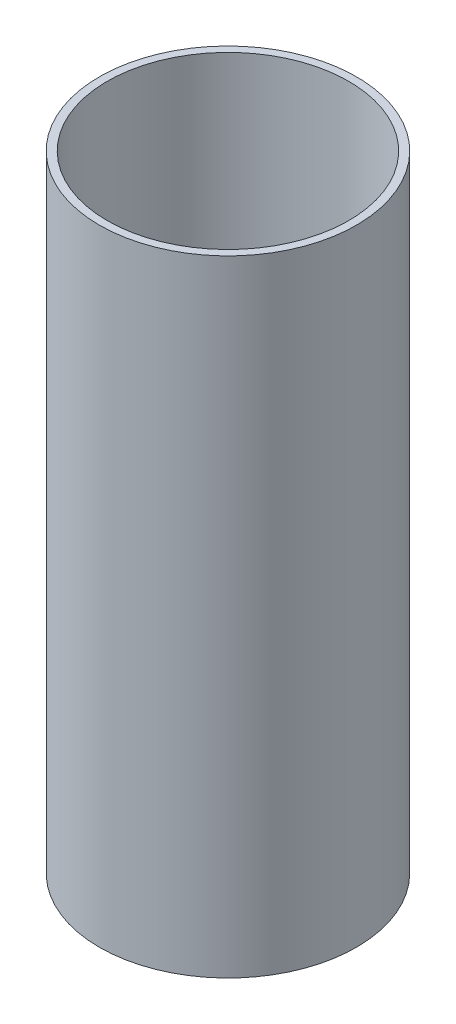
ISO-10303-21;
HEADER;
FILE_DESCRIPTION(('STEP AP214'),'2;1');
FILE_NAME('part.step','',(''),(''),'','','');
FILE_SCHEMA(('AUTOMOTIVE_DESIGN { 1 0 10303 214 1 1 1 1 }'));
ENDSEC;
DATA;
#1=APPLICATION_CONTEXT('core data for automotive mechanical design processes');
#2=APPLICATION_PROTOCOL_DEFINITION('international standard','automotive_design',2000,#1);
#3=PRODUCT_CONTEXT('',#1,'mechanical');
#4=PRODUCT('Part','Part','',(#3));
#5=PRODUCT_RELATED_PRODUCT_CATEGORY('part','',(#4));
#6=PRODUCT_DEFINITION_FORMATION('','',#4);
#7=PRODUCT_DEFINITION_CONTEXT('part definition',#1,'design');
#8=PRODUCT_DEFINITION('design','',#6,#7);
#9=PRODUCT_DEFINITION_SHAPE('','',#8);
#10=(LENGTH_UNIT() NAMED_UNIT(*) SI_UNIT(.MILLI.,.METRE.));
#11=(NAMED_UNIT(*) PLANE_ANGLE_UNIT() SI_UNIT($,.RADIAN.));
#12=(NAMED_UNIT(*) SI_UNIT($,.STERADIAN.) SOLID_ANGLE_UNIT());
#13=UNCERTAINTY_MEASURE_WITH_UNIT(LENGTH_MEASURE(1.E-05),#10,'distance_accuracy_value','');
#14=(GEOMETRIC_REPRESENTATION_CONTEXT(3) GLOBAL_UNCERTAINTY_ASSIGNED_CONTEXT((#13)) GLOBAL_UNIT_ASSIGNED_CONTEXT((#10,
#11,#12)) REPRESENTATION_CONTEXT('',''));
#15=CARTESIAN_POINT('',(0.,0.,0.));
#16=DIRECTION('',(0.,0.,1.));
#17=DIRECTION('',(1.,0.,0.));
#18=AXIS2_PLACEMENT_3D('',#15,#16,#17);
#19=CARTESIAN_POINT('',(0.,100.,0.));
#20=DIRECTION('',(0.,1.,0.));
#21=DIRECTION('',(0.,0.,1.));
#22=AXIS2_PLACEMENT_3D('',#19,#20,#21);
#23=PLANE('',#22);
#24=CARTESIAN_POINT('',(0.,100.,0.));
#25=DIRECTION('',(0.,1.,0.));
#26=DIRECTION('',(0.,0.,1.));
#27=AXIS2_PLACEMENT_3D('',#24,#25,#26);
#28=CIRCLE('',#27,20.555);
#29=CARTESIAN_POINT('',(0.,100.,20.555));
#30=VERTEX_POINT('',#29);
#31=EDGE_CURVE('E10',#30,#30,#28,.T.);
#32=ORIENTED_EDGE('',*,*,#31,.T.);
#33=EDGE_LOOP('',(#32));
#34=FACE_BOUND('',#33,.T.);
#35=CARTESIAN_POINT('',(0.,100.,0.));
#36=DIRECTION('',(0.,1.,0.));
#37=DIRECTION('',(0.,0.,1.));
#38=AXIS2_PLACEMENT_3D('',#35,#36,#37);
#39=CIRCLE('',#38,19.305);
#40=CARTESIAN_POINT('',(0.,100.,19.305));
#41=VERTEX_POINT('',#40);
#42=EDGE_CURVE('E55',#41,#41,#39,.T.);
#43=ORIENTED_EDGE('',*,*,#42,.F.);
#44=EDGE_LOOP('',(#43));
#45=FACE_BOUND('',#44,.T.);
#46=ADVANCED_FACE('F42',(#34,#45),#23,.T.);
#47=CARTESIAN_POINT('',(0.,0.,0.));
#48=DIRECTION('',(0.,1.,0.));
#49=DIRECTION('',(0.,0.,1.));
#50=AXIS2_PLACEMENT_3D('',#47,#48,#49);
#51=PLANE('',#50);
#52=CARTESIAN_POINT('',(0.,0.,0.));
#53=DIRECTION('',(0.,1.,0.));
#54=DIRECTION('',(0.,0.,1.));
#55=AXIS2_PLACEMENT_3D('',#52,#53,#54);
#56=CIRCLE('',#55,20.555);
#57=CARTESIAN_POINT('',(0.,0.,20.555));
#58=VERTEX_POINT('',#57);
#59=EDGE_CURVE('E46',#58,#58,#56,.T.);
#60=ORIENTED_EDGE('',*,*,#59,.F.);
#61=EDGE_LOOP('',(#60));
#62=FACE_BOUND('',#61,.T.);
#63=CARTESIAN_POINT('',(0.,0.,0.));
#64=DIRECTION('',(0.,1.,0.));
#65=DIRECTION('',(0.,0.,1.));
#66=AXIS2_PLACEMENT_3D('',#63,#64,#65);
#67=CIRCLE('',#66,19.305);
#68=CARTESIAN_POINT('',(0.,0.,19.305));
#69=VERTEX_POINT('',#68);
#70=EDGE_CURVE('E57',#69,#69,#67,.T.);
#71=ORIENTED_EDGE('',*,*,#70,.T.);
#72=EDGE_LOOP('',(#71));
#73=FACE_BOUND('',#72,.T.);
#74=ADVANCED_FACE('F69',(#62,#73),#51,.F.);
#75=CARTESIAN_POINT('',(0.,100.,0.));
#76=DIRECTION('',(0.,-1.,0.));
#77=DIRECTION('',(0.,0.,-1.));
#78=AXIS2_PLACEMENT_3D('',#75,#76,#77);
#79=CYLINDRICAL_SURFACE('',#78,20.555);
#80=ORIENTED_EDGE('',*,*,#31,.F.);
#81=EDGE_LOOP('',(#80));
#82=FACE_BOUND('',#81,.T.);
#83=ORIENTED_EDGE('',*,*,#59,.T.);
#84=EDGE_LOOP('',(#83));
#85=FACE_BOUND('',#84,.T.);
#86=ADVANCED_FACE('F44',(#82,#85),#79,.T.);
#87=CARTESIAN_POINT('',(0.,100.,0.));
#88=DIRECTION('',(0.,-1.,0.));
#89=DIRECTION('',(0.,0.,-1.));
#90=AXIS2_PLACEMENT_3D('',#87,#88,#89);
#91=CYLINDRICAL_SURFACE('',#90,19.305);
#92=ORIENTED_EDGE('',*,*,#42,.T.);
#93=EDGE_LOOP('',(#92));
#94=FACE_BOUND('',#93,.T.);
#95=ORIENTED_EDGE('',*,*,#70,.F.);
#96=EDGE_LOOP('',(#95));
#97=FACE_BOUND('',#96,.T.);
#98=ADVANCED_FACE('F65',(#94,#97),#91,.F.);
#99=CLOSED_SHELL('',(#46,#74,#86,#98));
#100=MANIFOLD_SOLID_BREP('B2',#99);
#101=ADVANCED_BREP_SHAPE_REPRESENTATION('',(#18,#100),#14);
#102=SHAPE_DEFINITION_REPRESENTATION(#9,#101);
ENDSEC;
END-ISO-10303-21;
